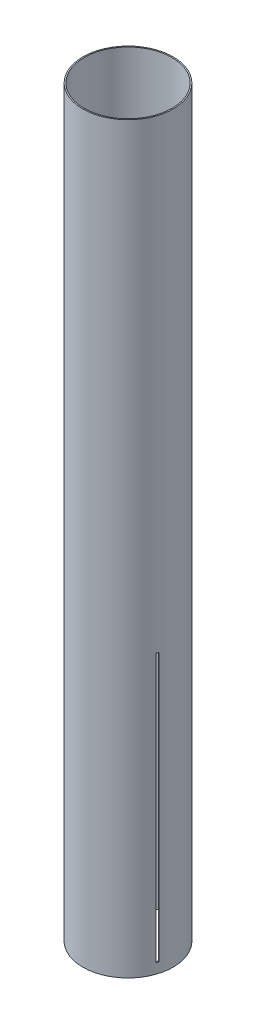
ISO-10303-21;
HEADER;
FILE_DESCRIPTION(('STEP AP214'),'2;1');
FILE_NAME('part.step','',(''),(''),'','','');
FILE_SCHEMA(('AUTOMOTIVE_DESIGN { 1 0 10303 214 1 1 1 1 }'));
ENDSEC;
DATA;
#1=APPLICATION_CONTEXT('core data for automotive mechanical design processes');
#2=APPLICATION_PROTOCOL_DEFINITION('international standard','automotive_design',2000,#1);
#3=PRODUCT_CONTEXT('',#1,'mechanical');
#4=PRODUCT('Part','Part','',(#3));
#5=PRODUCT_RELATED_PRODUCT_CATEGORY('part','',(#4));
#6=PRODUCT_DEFINITION_FORMATION('','',#4);
#7=PRODUCT_DEFINITION_CONTEXT('part definition',#1,'design');
#8=PRODUCT_DEFINITION('design','',#6,#7);
#9=PRODUCT_DEFINITION_SHAPE('','',#8);
#10=(LENGTH_UNIT() NAMED_UNIT(*) SI_UNIT(.MILLI.,.METRE.));
#11=(NAMED_UNIT(*) PLANE_ANGLE_UNIT() SI_UNIT($,.RADIAN.));
#12=(NAMED_UNIT(*) SI_UNIT($,.STERADIAN.) SOLID_ANGLE_UNIT());
#13=UNCERTAINTY_MEASURE_WITH_UNIT(LENGTH_MEASURE(1.E-05),#10,'distance_accuracy_value','');
#14=(GEOMETRIC_REPRESENTATION_CONTEXT(3) GLOBAL_UNCERTAINTY_ASSIGNED_CONTEXT((#13)) GLOBAL_UNIT_ASSIGNED_CONTEXT((#10,
#11,#12)) REPRESENTATION_CONTEXT('',''));
#15=CARTESIAN_POINT('',(0.,0.,0.));
#16=DIRECTION('',(0.,0.,1.));
#17=DIRECTION('',(1.,0.,0.));
#18=AXIS2_PLACEMENT_3D('',#15,#16,#17);
#19=CARTESIAN_POINT('',(0.,838.2,0.));
#20=DIRECTION('',(0.,1.,0.));
#21=DIRECTION('',(0.,0.,1.));
#22=AXIS2_PLACEMENT_3D('',#19,#20,#21);
#23=PLANE('',#22);
#24=CARTESIAN_POINT('',(0.,838.2,0.));
#25=DIRECTION('',(0.,1.,0.));
#26=DIRECTION('',(0.,0.,1.));
#27=AXIS2_PLACEMENT_3D('',#24,#25,#26);
#28=CIRCLE('',#27,50.9524);
#29=CARTESIAN_POINT('',(0.,838.2,50.9524));
#30=VERTEX_POINT('',#29);
#31=EDGE_CURVE('E193',#30,#30,#28,.T.);
#32=ORIENTED_EDGE('',*,*,#31,.T.);
#33=EDGE_LOOP('',(#32));
#34=FACE_BOUND('',#33,.T.);
#35=CARTESIAN_POINT('',(0.,838.2,0.));
#36=DIRECTION('',(0.,1.,0.));
#37=DIRECTION('',(0.,0.,1.));
#38=AXIS2_PLACEMENT_3D('',#35,#36,#37);
#39=CIRCLE('',#38,49.5808);
#40=CARTESIAN_POINT('',(0.,838.2,49.5808));
#41=VERTEX_POINT('',#40);
#42=EDGE_CURVE('E187',#41,#41,#39,.T.);
#43=ORIENTED_EDGE('',*,*,#42,.F.);
#44=EDGE_LOOP('',(#43));
#45=FACE_BOUND('',#44,.T.);
#46=ADVANCED_FACE('F39',(#34,#45),#23,.T.);
#47=CARTESIAN_POINT('',(0.,0.,0.));
#48=DIRECTION('',(0.,1.,0.));
#49=DIRECTION('',(0.,0.,1.));
#50=AXIS2_PLACEMENT_3D('',#47,#48,#49);
#51=PLANE('',#50);
#52=CARTESIAN_POINT('',(0.,0.,0.));
#53=DIRECTION('',(0.,1.,0.));
#54=DIRECTION('',(0.,0.,1.));
#55=AXIS2_PLACEMENT_3D('',#52,#53,#54);
#56=CIRCLE('',#55,50.9524);
#57=CARTESIAN_POINT('',(0.,0.,50.9524));
#58=VERTEX_POINT('',#57);
#59=EDGE_CURVE('E190',#58,#58,#56,.T.);
#60=ORIENTED_EDGE('',*,*,#59,.F.);
#61=EDGE_LOOP('',(#60));
#62=FACE_BOUND('',#61,.T.);
#63=CARTESIAN_POINT('',(0.,0.,0.));
#64=DIRECTION('',(0.,1.,0.));
#65=DIRECTION('',(0.,0.,1.));
#66=AXIS2_PLACEMENT_3D('',#63,#64,#65);
#67=CIRCLE('',#66,49.5808);
#68=CARTESIAN_POINT('',(0.,0.,49.5808));
#69=VERTEX_POINT('',#68);
#70=EDGE_CURVE('E186',#69,#69,#67,.T.);
#71=ORIENTED_EDGE('',*,*,#70,.T.);
#72=EDGE_LOOP('',(#71));
#73=FACE_BOUND('',#72,.T.);
#74=ADVANCED_FACE('F265',(#62,#73),#51,.F.);
#75=CARTESIAN_POINT('',(0.,838.2,0.));
#76=DIRECTION('',(0.,-1.,0.));
#77=DIRECTION('',(0.,0.,-1.));
#78=AXIS2_PLACEMENT_3D('',#75,#76,#77);
#79=CYLINDRICAL_SURFACE('',#78,50.9524);
#80=DIRECTION('',(0.,-1.,0.));
#81=VECTOR('',#80,1.);
#82=CARTESIAN_POINT('',(49.0348088183998,838.2,13.8468259865928));
#83=LINE('',#82,#81);
#84=CARTESIAN_POINT('',(49.0348088183998,11.3538,13.8468259865928));
#85=VERTEX_POINT('',#84);
#86=CARTESIAN_POINT('',(49.0348088183998,313.6138,13.8468259865928));
#87=VERTEX_POINT('',#86);
#88=EDGE_CURVE('E159',#85,#87,#83,.F.);
#89=ORIENTED_EDGE('',*,*,#88,.F.);
#90=CARTESIAN_POINT('',(0.,11.3538,0.));
#91=DIRECTION('',(0.,-1.,0.));
#92=DIRECTION('',(0.,0.,-1.));
#93=AXIS2_PLACEMENT_3D('',#90,#91,#92);
#94=CIRCLE('',#93,50.9524);
#95=CARTESIAN_POINT('',(48.1118693597065,11.3538,16.7748350953008));
#96=VERTEX_POINT('',#95);
#97=EDGE_CURVE('E161',#85,#96,#94,.T.);
#98=ORIENTED_EDGE('',*,*,#97,.T.);
#99=DIRECTION('',(0.,-1.,0.));
#100=VECTOR('',#99,1.);
#101=CARTESIAN_POINT('',(48.1118693597065,838.2,16.7748350953008));
#102=LINE('',#101,#100);
#103=CARTESIAN_POINT('',(48.1118693597065,313.6138,16.7748350953008));
#104=VERTEX_POINT('',#103);
#105=EDGE_CURVE('E150',#96,#104,#102,.F.);
#106=ORIENTED_EDGE('',*,*,#105,.T.);
#107=CARTESIAN_POINT('',(0.,313.6138,0.));
#108=DIRECTION('',(0.,-1.,0.));
#109=DIRECTION('',(0.,0.,-1.));
#110=AXIS2_PLACEMENT_3D('',#107,#108,#109);
#111=CIRCLE('',#110,50.9524);
#112=EDGE_CURVE('E153',#87,#104,#111,.T.);
#113=ORIENTED_EDGE('',*,*,#112,.F.);
#114=EDGE_LOOP('',(#89,#98,#106,#113));
#115=FACE_BOUND('',#114,.T.);
#116=DIRECTION('',(0.,-1.,0.));
#117=VECTOR('',#116,1.);
#118=CARTESIAN_POINT('',(-36.509107475372,838.2,35.5419771131508));
#119=LINE('',#118,#117);
#120=CARTESIAN_POINT('',(-36.509107475372,11.3538,35.5419771131508));
#121=VERTEX_POINT('',#120);
#122=CARTESIAN_POINT('',(-36.509107475372,313.6138,35.5419771131508));
#123=VERTEX_POINT('',#122);
#124=EDGE_CURVE('E149',#121,#123,#119,.F.);
#125=ORIENTED_EDGE('',*,*,#124,.F.);
#126=CARTESIAN_POINT('',(0.,11.3538,0.));
#127=DIRECTION('',(0.,-1.,0.));
#128=DIRECTION('',(0.,0.,-1.));
#129=AXIS2_PLACEMENT_3D('',#126,#127,#128);
#130=CIRCLE('',#129,50.9524);
#131=CARTESIAN_POINT('',(-38.5833680166787,11.3538,33.2786835414134));
#132=VERTEX_POINT('',#131);
#133=EDGE_CURVE('E140',#121,#132,#130,.T.);
#134=ORIENTED_EDGE('',*,*,#133,.T.);
#135=DIRECTION('',(0.,-1.,0.));
#136=VECTOR('',#135,1.);
#137=CARTESIAN_POINT('',(-38.5833680166787,838.2,33.2786835414134));
#138=LINE('',#137,#136);
#139=CARTESIAN_POINT('',(-38.5833680166787,313.6138,33.2786835414134));
#140=VERTEX_POINT('',#139);
#141=EDGE_CURVE('E126',#132,#140,#138,.F.);
#142=ORIENTED_EDGE('',*,*,#141,.T.);
#143=CARTESIAN_POINT('',(0.,313.6138,0.));
#144=DIRECTION('',(0.,-1.,0.));
#145=DIRECTION('',(0.,0.,-1.));
#146=AXIS2_PLACEMENT_3D('',#143,#144,#145);
#147=CIRCLE('',#146,50.9524);
#148=EDGE_CURVE('E134',#123,#140,#147,.T.);
#149=ORIENTED_EDGE('',*,*,#148,.F.);
#150=EDGE_LOOP('',(#125,#134,#142,#149));
#151=FACE_BOUND('',#150,.T.);
#152=DIRECTION('',(0.,-1.,0.));
#153=VECTOR('',#152,1.);
#154=CARTESIAN_POINT('',(-12.5257013430275,838.2,-49.388803099744));
#155=LINE('',#154,#153);
#156=CARTESIAN_POINT('',(-12.5257013430275,11.3538,-49.388803099744));
#157=VERTEX_POINT('',#156);
#158=CARTESIAN_POINT('',(-12.5257013430275,313.6138,-49.388803099744));
#159=VERTEX_POINT('',#158);
#160=EDGE_CURVE('E181',#157,#159,#155,.F.);
#161=ORIENTED_EDGE('',*,*,#160,.F.);
#162=CARTESIAN_POINT('',(0.,11.3538,0.));
#163=DIRECTION('',(0.,-1.,0.));
#164=DIRECTION('',(0.,0.,-1.));
#165=AXIS2_PLACEMENT_3D('',#162,#163,#164);
#166=CIRCLE('',#165,50.9524);
#167=CARTESIAN_POINT('',(-9.52850134302751,11.3538,-50.0535186367145));
#168=VERTEX_POINT('',#167);
#169=EDGE_CURVE('E183',#157,#168,#166,.T.);
#170=ORIENTED_EDGE('',*,*,#169,.T.);
#171=DIRECTION('',(0.,-1.,0.));
#172=VECTOR('',#171,1.);
#173=CARTESIAN_POINT('',(-9.52850134302751,838.2,-50.0535186367145));
#174=LINE('',#173,#172);
#175=CARTESIAN_POINT('',(-9.52850134302751,313.6138,-50.0535186367145));
#176=VERTEX_POINT('',#175);
#177=EDGE_CURVE('E168',#168,#176,#174,.F.);
#178=ORIENTED_EDGE('',*,*,#177,.T.);
#179=CARTESIAN_POINT('',(0.,313.6138,0.));
#180=DIRECTION('',(0.,-1.,0.));
#181=DIRECTION('',(0.,0.,-1.));
#182=AXIS2_PLACEMENT_3D('',#179,#180,#181);
#183=CIRCLE('',#182,50.9524);
#184=EDGE_CURVE('E178',#159,#176,#183,.T.);
#185=ORIENTED_EDGE('',*,*,#184,.F.);
#186=EDGE_LOOP('',(#161,#170,#178,#185));
#187=FACE_BOUND('',#186,.T.);
#188=ORIENTED_EDGE('',*,*,#31,.F.);
#189=EDGE_LOOP('',(#188));
#190=FACE_BOUND('',#189,.T.);
#191=ORIENTED_EDGE('',*,*,#59,.T.);
#192=EDGE_LOOP('',(#191));
#193=FACE_BOUND('',#192,.T.);
#194=ADVANCED_FACE('F41',(#115,#151,#187,#190,#193),#79,.T.);
#195=CARTESIAN_POINT('',(0.,838.2,0.));
#196=DIRECTION('',(0.,-1.,0.));
#197=DIRECTION('',(0.,0.,-1.));
#198=AXIS2_PLACEMENT_3D('',#195,#196,#197);
#199=CYLINDRICAL_SURFACE('',#198,49.5808);
#200=CARTESIAN_POINT('',(0.,11.3538,0.));
#201=DIRECTION('',(0.,-1.,0.));
#202=DIRECTION('',(0.,0.,-1.));
#203=AXIS2_PLACEMENT_3D('',#200,#201,#202);
#204=CIRCLE('',#203,49.5808);
#205=CARTESIAN_POINT('',(47.8082704055707,11.3538,13.1386837037746));
#206=VERTEX_POINT('',#205);
#207=CARTESIAN_POINT('',(46.90209047254,11.3538000000001,16.0763689291354));
#208=VERTEX_POINT('',#207);
#209=EDGE_CURVE('E11',#206,#208,#204,.T.);
#210=ORIENTED_EDGE('',*,*,#209,.F.);
#211=DIRECTION('',(0.,-1.,0.));
#212=VECTOR('',#211,1.);
#213=CARTESIAN_POINT('',(47.8082704055707,838.2,13.1386837037746));
#214=LINE('',#213,#212);
#215=CARTESIAN_POINT('',(47.8082704055707,313.6138,13.1386837037746));
#216=VERTEX_POINT('',#215);
#217=EDGE_CURVE('E47',#206,#216,#214,.F.);
#218=ORIENTED_EDGE('',*,*,#217,.T.);
#219=CARTESIAN_POINT('',(0.,313.6138,0.));
#220=DIRECTION('',(0.,-1.,0.));
#221=DIRECTION('',(0.,0.,-1.));
#222=AXIS2_PLACEMENT_3D('',#219,#220,#221);
#223=CIRCLE('',#222,49.5808);
#224=CARTESIAN_POINT('',(46.90209047254,313.6138,16.0763689291354));
#225=VERTEX_POINT('',#224);
#226=EDGE_CURVE('E220',#216,#225,#223,.T.);
#227=ORIENTED_EDGE('',*,*,#226,.T.);
#228=DIRECTION('',(0.,-1.,0.));
#229=VECTOR('',#228,1.);
#230=CARTESIAN_POINT('',(46.90209047254,838.2,16.0763689291354));
#231=LINE('',#230,#229);
#232=EDGE_CURVE('E218',#208,#225,#231,.F.);
#233=ORIENTED_EDGE('',*,*,#232,.F.);
#234=EDGE_LOOP('',(#210,#218,#227,#233));
#235=FACE_BOUND('',#234,.T.);
#236=CARTESIAN_POINT('',(0.,11.3538,0.));
#237=DIRECTION('',(0.,-1.,0.));
#238=DIRECTION('',(0.,0.,-1.));
#239=AXIS2_PLACEMENT_3D('',#236,#237,#238);
#240=CIRCLE('',#239,49.5808);
#241=CARTESIAN_POINT('',(-35.2825690625429,11.3538,34.8338348303326));
#242=VERTEX_POINT('',#241);
#243=CARTESIAN_POINT('',(-37.3735891295122,11.3538000000001,32.5802173752479));
#244=VERTEX_POINT('',#243);
#245=EDGE_CURVE('E143',#242,#244,#240,.T.);
#246=ORIENTED_EDGE('',*,*,#245,.F.);
#247=DIRECTION('',(0.,-1.,0.));
#248=VECTOR('',#247,1.);
#249=CARTESIAN_POINT('',(-35.2825690625429,838.2,34.8338348303326));
#250=LINE('',#249,#248);
#251=CARTESIAN_POINT('',(-35.2825690625429,313.6138,34.8338348303326));
#252=VERTEX_POINT('',#251);
#253=EDGE_CURVE('E214',#242,#252,#250,.F.);
#254=ORIENTED_EDGE('',*,*,#253,.T.);
#255=CARTESIAN_POINT('',(0.,313.6138,0.));
#256=DIRECTION('',(0.,-1.,0.));
#257=DIRECTION('',(0.,0.,-1.));
#258=AXIS2_PLACEMENT_3D('',#255,#256,#257);
#259=CIRCLE('',#258,49.5808);
#260=CARTESIAN_POINT('',(-37.3735891295122,313.6138,32.5802173752479));
#261=VERTEX_POINT('',#260);
#262=EDGE_CURVE('E211',#252,#261,#259,.T.);
#263=ORIENTED_EDGE('',*,*,#262,.T.);
#264=DIRECTION('',(0.,-1.,0.));
#265=VECTOR('',#264,1.);
#266=CARTESIAN_POINT('',(-37.3735891295122,838.2,32.5802173752479));
#267=LINE('',#266,#265);
#268=EDGE_CURVE('E209',#244,#261,#267,.F.);
#269=ORIENTED_EDGE('',*,*,#268,.F.);
#270=EDGE_LOOP('',(#246,#254,#263,#269));
#271=FACE_BOUND('',#270,.T.);
#272=CARTESIAN_POINT('',(0.,11.3538,0.));
#273=DIRECTION('',(0.,-1.,0.));
#274=DIRECTION('',(0.,0.,-1.));
#275=AXIS2_PLACEMENT_3D('',#272,#273,#274);
#276=CIRCLE('',#275,49.5808);
#277=CARTESIAN_POINT('',(-12.5257013430275,11.3538,-47.9725185341074));
#278=VERTEX_POINT('',#277);
#279=CARTESIAN_POINT('',(-9.52850134302751,11.3538000000001,-48.6565863043835));
#280=VERTEX_POINT('',#279);
#281=EDGE_CURVE('E206',#278,#280,#276,.T.);
#282=ORIENTED_EDGE('',*,*,#281,.F.);
#283=DIRECTION('',(0.,-1.,0.));
#284=VECTOR('',#283,1.);
#285=CARTESIAN_POINT('',(-12.5257013430275,838.2,-47.9725185341074));
#286=LINE('',#285,#284);
#287=CARTESIAN_POINT('',(-12.5257013430275,313.6138,-47.9725185341074));
#288=VERTEX_POINT('',#287);
#289=EDGE_CURVE('E203',#278,#288,#286,.F.);
#290=ORIENTED_EDGE('',*,*,#289,.T.);
#291=CARTESIAN_POINT('',(0.,313.6138,0.));
#292=DIRECTION('',(0.,-1.,0.));
#293=DIRECTION('',(0.,0.,-1.));
#294=AXIS2_PLACEMENT_3D('',#291,#292,#293);
#295=CIRCLE('',#294,49.5808);
#296=CARTESIAN_POINT('',(-9.52850134302751,313.6138,-48.6565863043835));
#297=VERTEX_POINT('',#296);
#298=EDGE_CURVE('E200',#288,#297,#295,.T.);
#299=ORIENTED_EDGE('',*,*,#298,.T.);
#300=DIRECTION('',(0.,-1.,0.));
#301=VECTOR('',#300,1.);
#302=CARTESIAN_POINT('',(-9.52850134302751,838.2,-48.6565863043835));
#303=LINE('',#302,#301);
#304=EDGE_CURVE('E196',#280,#297,#303,.F.);
#305=ORIENTED_EDGE('',*,*,#304,.F.);
#306=EDGE_LOOP('',(#282,#290,#299,#305));
#307=FACE_BOUND('',#306,.T.);
#308=ORIENTED_EDGE('',*,*,#42,.T.);
#309=EDGE_LOOP('',(#308));
#310=FACE_BOUND('',#309,.T.);
#311=ORIENTED_EDGE('',*,*,#70,.F.);
#312=EDGE_LOOP('',(#311));
#313=FACE_BOUND('',#312,.T.);
#314=ADVANCED_FACE('F225',(#235,#271,#307,#310,#313),#199,.F.);
#315=CARTESIAN_POINT('',(0.,11.3538,-50.9524));
#316=DIRECTION('',(0.,-1.,0.));
#317=DIRECTION('',(0.,0.,-1.));
#318=AXIS2_PLACEMENT_3D('',#315,#316,#317);
#319=PLANE('',#318);
#320=DIRECTION('',(0.,0.,1.));
#321=VECTOR('',#320,1.);
#322=CARTESIAN_POINT('',(-12.5257013430275,11.3538,-50.9524));
#323=LINE('',#322,#321);
#324=EDGE_CURVE('E165',#157,#278,#323,.T.);
#325=ORIENTED_EDGE('',*,*,#324,.T.);
#326=ORIENTED_EDGE('',*,*,#281,.T.);
#327=DIRECTION('',(0.,0.,1.));
#328=VECTOR('',#327,1.);
#329=CARTESIAN_POINT('',(-9.52850134302751,11.3538,-50.9524));
#330=LINE('',#329,#328);
#331=EDGE_CURVE('E164',#168,#280,#330,.T.);
#332=ORIENTED_EDGE('',*,*,#331,.F.);
#333=ORIENTED_EDGE('',*,*,#169,.F.);
#334=EDGE_LOOP('',(#325,#326,#332,#333));
#335=FACE_BOUND('',#334,.T.);
#336=ADVANCED_FACE('F256',(#335),#319,.F.);
#337=CARTESIAN_POINT('',(-12.5257013430275,0.,-50.9524));
#338=DIRECTION('',(1.,0.,0.));
#339=DIRECTION('',(0.,0.,-1.));
#340=AXIS2_PLACEMENT_3D('',#337,#338,#339);
#341=PLANE('',#340);
#342=ORIENTED_EDGE('',*,*,#160,.T.);
#343=DIRECTION('',(0.,0.,1.));
#344=VECTOR('',#343,1.);
#345=CARTESIAN_POINT('',(-12.5257013430275,313.6138,-50.9524));
#346=LINE('',#345,#344);
#347=EDGE_CURVE('E169',#159,#288,#346,.T.);
#348=ORIENTED_EDGE('',*,*,#347,.T.);
#349=ORIENTED_EDGE('',*,*,#289,.F.);
#350=ORIENTED_EDGE('',*,*,#324,.F.);
#351=EDGE_LOOP('',(#342,#348,#349,#350));
#352=FACE_BOUND('',#351,.T.);
#353=ADVANCED_FACE('F279',(#352),#341,.T.);
#354=CARTESIAN_POINT('',(0.,313.6138,-50.9524));
#355=DIRECTION('',(0.,-1.,0.));
#356=DIRECTION('',(0.,0.,-1.));
#357=AXIS2_PLACEMENT_3D('',#354,#355,#356);
#358=PLANE('',#357);
#359=ORIENTED_EDGE('',*,*,#184,.T.);
#360=DIRECTION('',(0.,0.,1.));
#361=VECTOR('',#360,1.);
#362=CARTESIAN_POINT('',(-9.52850134302751,313.6138,-50.9524));
#363=LINE('',#362,#361);
#364=EDGE_CURVE('E172',#176,#297,#363,.T.);
#365=ORIENTED_EDGE('',*,*,#364,.T.);
#366=ORIENTED_EDGE('',*,*,#298,.F.);
#367=ORIENTED_EDGE('',*,*,#347,.F.);
#368=EDGE_LOOP('',(#359,#365,#366,#367));
#369=FACE_BOUND('',#368,.T.);
#370=ADVANCED_FACE('F284',(#369),#358,.T.);
#371=CARTESIAN_POINT('',(-9.52850134302751,0.,-50.9524));
#372=DIRECTION('',(1.,0.,0.));
#373=DIRECTION('',(0.,0.,-1.));
#374=AXIS2_PLACEMENT_3D('',#371,#372,#373);
#375=PLANE('',#374);
#376=ORIENTED_EDGE('',*,*,#331,.T.);
#377=ORIENTED_EDGE('',*,*,#304,.T.);
#378=ORIENTED_EDGE('',*,*,#364,.F.);
#379=ORIENTED_EDGE('',*,*,#177,.F.);
#380=EDGE_LOOP('',(#376,#377,#378,#379));
#381=FACE_BOUND('',#380,.T.);
#382=ADVANCED_FACE('F281',(#381),#375,.F.);
#383=CARTESIAN_POINT('',(-60.277336391893,11.3538,34.8011363918934));
#384=DIRECTION('',(0.,-1.,0.));
#385=DIRECTION('',(0.,0.,-1.));
#386=AXIS2_PLACEMENT_3D('',#383,#384,#385);
#387=PLANE('',#386);
#388=DIRECTION('',(0.866025403784436,0.,-0.500000000000004));
#389=VECTOR('',#388,1.);
#390=CARTESIAN_POINT('',(-54.0144857203792,11.3538,45.6487119551721));
#391=LINE('',#390,#389);
#392=EDGE_CURVE('E135',#121,#242,#391,.T.);
#393=ORIENTED_EDGE('',*,*,#392,.T.);
#394=ORIENTED_EDGE('',*,*,#245,.T.);
#395=DIRECTION('',(0.866025403784436,0.,-0.500000000000004));
#396=VECTOR('',#395,1.);
#397=CARTESIAN_POINT('',(-55.5130857203792,11.3538,43.0530606149494));
#398=LINE('',#397,#396);
#399=EDGE_CURVE('E129',#132,#244,#398,.T.);
#400=ORIENTED_EDGE('',*,*,#399,.F.);
#401=ORIENTED_EDGE('',*,*,#133,.F.);
#402=EDGE_LOOP('',(#393,#394,#400,#401));
#403=FACE_BOUND('',#402,.T.);
#404=ADVANCED_FACE('F139',(#403),#387,.F.);
#405=CARTESIAN_POINT('',(-54.0144857203792,0.,45.6487119551721));
#406=DIRECTION('',(-0.500000000000004,0.,-0.866025403784436));
#407=DIRECTION('',(-0.866025403784436,0.,0.500000000000004));
#408=AXIS2_PLACEMENT_3D('',#405,#406,#407);
#409=PLANE('',#408);
#410=ORIENTED_EDGE('',*,*,#124,.T.);
#411=DIRECTION('',(0.866025403784436,0.,-0.500000000000004));
#412=VECTOR('',#411,1.);
#413=CARTESIAN_POINT('',(-54.0144857203792,313.6138,45.6487119551721));
#414=LINE('',#413,#412);
#415=EDGE_CURVE('E246',#123,#252,#414,.T.);
#416=ORIENTED_EDGE('',*,*,#415,.T.);
#417=ORIENTED_EDGE('',*,*,#253,.F.);
#418=ORIENTED_EDGE('',*,*,#392,.F.);
#419=EDGE_LOOP('',(#410,#416,#417,#418));
#420=FACE_BOUND('',#419,.T.);
#421=ADVANCED_FACE('F253',(#420),#409,.T.);
#422=CARTESIAN_POINT('',(-60.277336391893,313.6138,34.8011363918934));
#423=DIRECTION('',(0.,-1.,0.));
#424=DIRECTION('',(0.,0.,-1.));
#425=AXIS2_PLACEMENT_3D('',#422,#423,#424);
#426=PLANE('',#425);
#427=ORIENTED_EDGE('',*,*,#148,.T.);
#428=DIRECTION('',(0.866025403784436,0.,-0.500000000000004));
#429=VECTOR('',#428,1.);
#430=CARTESIAN_POINT('',(-55.5130857203792,313.6138,43.0530606149494));
#431=LINE('',#430,#429);
#432=EDGE_CURVE('E62',#140,#261,#431,.T.);
#433=ORIENTED_EDGE('',*,*,#432,.T.);
#434=ORIENTED_EDGE('',*,*,#262,.F.);
#435=ORIENTED_EDGE('',*,*,#415,.F.);
#436=EDGE_LOOP('',(#427,#433,#434,#435));
#437=FACE_BOUND('',#436,.T.);
#438=ADVANCED_FACE('F251',(#437),#426,.T.);
#439=CARTESIAN_POINT('',(-55.5130857203792,0.,43.0530606149494));
#440=DIRECTION('',(-0.500000000000004,0.,-0.866025403784436));
#441=DIRECTION('',(-0.866025403784436,0.,0.500000000000004));
#442=AXIS2_PLACEMENT_3D('',#439,#440,#441);
#443=PLANE('',#442);
#444=ORIENTED_EDGE('',*,*,#399,.T.);
#445=ORIENTED_EDGE('',*,*,#268,.T.);
#446=ORIENTED_EDGE('',*,*,#432,.F.);
#447=ORIENTED_EDGE('',*,*,#141,.F.);
#448=EDGE_LOOP('',(#444,#445,#446,#447));
#449=FACE_BOUND('',#448,.T.);
#450=ADVANCED_FACE('F128',(#449),#443,.F.);
#451=CARTESIAN_POINT('',(60.2773363918933,11.3538,34.8011363918925));
#452=DIRECTION('',(0.,-1.,0.));
#453=DIRECTION('',(0.,0.,-1.));
#454=AXIS2_PLACEMENT_3D('',#451,#452,#453);
#455=PLANE('',#454);
#456=DIRECTION('',(-0.866025403784443,0.,-0.499999999999992));
#457=VECTOR('',#456,1.);
#458=CARTESIAN_POINT('',(66.5401870634069,11.3538,23.9535608286137));
#459=LINE('',#458,#457);
#460=EDGE_CURVE('E145',#85,#206,#459,.T.);
#461=ORIENTED_EDGE('',*,*,#460,.T.);
#462=ORIENTED_EDGE('',*,*,#209,.T.);
#463=DIRECTION('',(-0.866025403784443,0.,-0.499999999999992));
#464=VECTOR('',#463,1.);
#465=CARTESIAN_POINT('',(65.041587063407,11.3538,26.5492121688365));
#466=LINE('',#465,#464);
#467=EDGE_CURVE('E243',#96,#208,#466,.T.);
#468=ORIENTED_EDGE('',*,*,#467,.F.);
#469=ORIENTED_EDGE('',*,*,#97,.F.);
#470=EDGE_LOOP('',(#461,#462,#468,#469));
#471=FACE_BOUND('',#470,.T.);
#472=ADVANCED_FACE('F237',(#471),#455,.F.);
#473=CARTESIAN_POINT('',(66.5401870634069,0.,23.9535608286137));
#474=DIRECTION('',(-0.499999999999992,0.,0.866025403784443));
#475=DIRECTION('',(0.866025403784443,0.,0.499999999999992));
#476=AXIS2_PLACEMENT_3D('',#473,#474,#475);
#477=PLANE('',#476);
#478=ORIENTED_EDGE('',*,*,#88,.T.);
#479=DIRECTION('',(-0.866025403784443,0.,-0.499999999999992));
#480=VECTOR('',#479,1.);
#481=CARTESIAN_POINT('',(66.5401870634069,313.6138,23.9535608286137));
#482=LINE('',#481,#480);
#483=EDGE_CURVE('E235',#87,#216,#482,.T.);
#484=ORIENTED_EDGE('',*,*,#483,.T.);
#485=ORIENTED_EDGE('',*,*,#217,.F.);
#486=ORIENTED_EDGE('',*,*,#460,.F.);
#487=EDGE_LOOP('',(#478,#484,#485,#486));
#488=FACE_BOUND('',#487,.T.);
#489=ADVANCED_FACE('F232',(#488),#477,.T.);
#490=CARTESIAN_POINT('',(60.2773363918933,313.6138,34.8011363918925));
#491=DIRECTION('',(0.,-1.,0.));
#492=DIRECTION('',(0.,0.,-1.));
#493=AXIS2_PLACEMENT_3D('',#490,#491,#492);
#494=PLANE('',#493);
#495=ORIENTED_EDGE('',*,*,#112,.T.);
#496=DIRECTION('',(-0.866025403784443,0.,-0.499999999999992));
#497=VECTOR('',#496,1.);
#498=CARTESIAN_POINT('',(65.041587063407,313.6138,26.5492121688365));
#499=LINE('',#498,#497);
#500=EDGE_CURVE('E54',#104,#225,#499,.T.);
#501=ORIENTED_EDGE('',*,*,#500,.T.);
#502=ORIENTED_EDGE('',*,*,#226,.F.);
#503=ORIENTED_EDGE('',*,*,#483,.F.);
#504=EDGE_LOOP('',(#495,#501,#502,#503));
#505=FACE_BOUND('',#504,.T.);
#506=ADVANCED_FACE('F305',(#505),#494,.T.);
#507=CARTESIAN_POINT('',(65.041587063407,0.,26.5492121688365));
#508=DIRECTION('',(-0.499999999999992,0.,0.866025403784443));
#509=DIRECTION('',(0.866025403784443,0.,0.499999999999992));
#510=AXIS2_PLACEMENT_3D('',#507,#508,#509);
#511=PLANE('',#510);
#512=ORIENTED_EDGE('',*,*,#467,.T.);
#513=ORIENTED_EDGE('',*,*,#232,.T.);
#514=ORIENTED_EDGE('',*,*,#500,.F.);
#515=ORIENTED_EDGE('',*,*,#105,.F.);
#516=EDGE_LOOP('',(#512,#513,#514,#515));
#517=FACE_BOUND('',#516,.T.);
#518=ADVANCED_FACE('F302',(#517),#511,.F.);
#519=CLOSED_SHELL('',(#46,#74,#194,#314,#336,#353,#370,#382,#404,#421,#438,#450,#472,#489,#506,#518));
#520=MANIFOLD_SOLID_BREP('B2',#519);
#521=ADVANCED_BREP_SHAPE_REPRESENTATION('',(#18,#520),#14);
#522=SHAPE_DEFINITION_REPRESENTATION(#9,#521);
ENDSEC;
END-ISO-10303-21;
